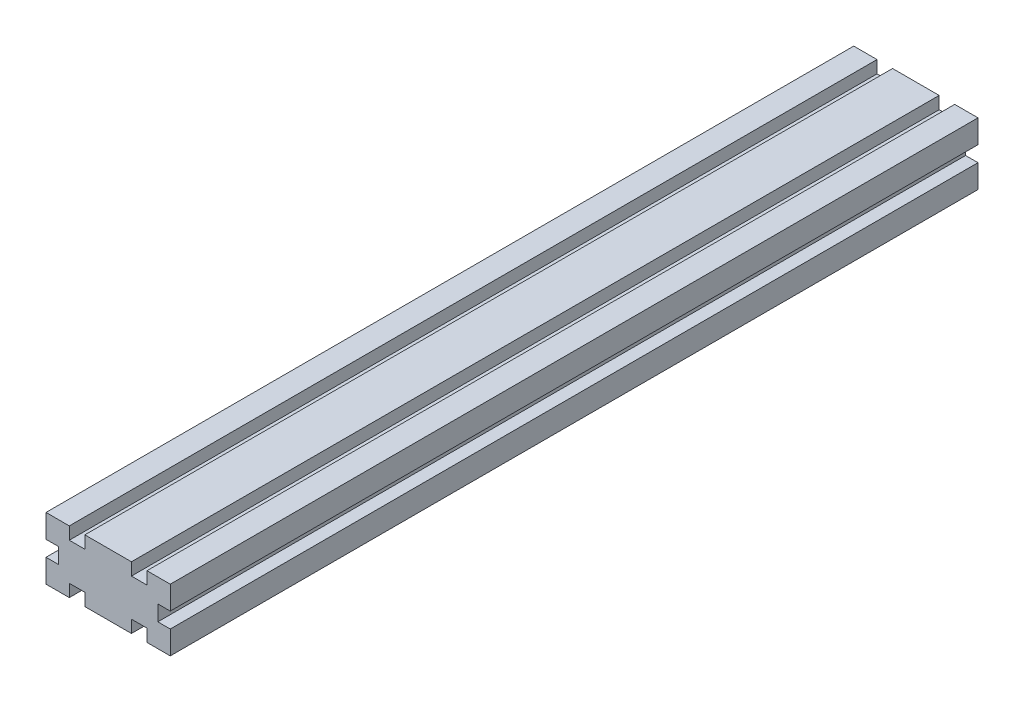
ISO-10303-21;
HEADER;
FILE_DESCRIPTION(('STEP AP214'),'2;1');
FILE_NAME('part.step','',(''),(''),'','','');
FILE_SCHEMA(('AUTOMOTIVE_DESIGN { 1 0 10303 214 1 1 1 1 }'));
ENDSEC;
DATA;
#1=APPLICATION_CONTEXT('core data for automotive mechanical design processes');
#2=APPLICATION_PROTOCOL_DEFINITION('international standard','automotive_design',2000,#1);
#3=PRODUCT_CONTEXT('',#1,'mechanical');
#4=PRODUCT('Part','Part','',(#3));
#5=PRODUCT_RELATED_PRODUCT_CATEGORY('part','',(#4));
#6=PRODUCT_DEFINITION_FORMATION('','',#4);
#7=PRODUCT_DEFINITION_CONTEXT('part definition',#1,'design');
#8=PRODUCT_DEFINITION('design','',#6,#7);
#9=PRODUCT_DEFINITION_SHAPE('','',#8);
#10=(LENGTH_UNIT() NAMED_UNIT(*) SI_UNIT(.MILLI.,.METRE.));
#11=(NAMED_UNIT(*) PLANE_ANGLE_UNIT() SI_UNIT($,.RADIAN.));
#12=(NAMED_UNIT(*) SI_UNIT($,.STERADIAN.) SOLID_ANGLE_UNIT());
#13=UNCERTAINTY_MEASURE_WITH_UNIT(LENGTH_MEASURE(1.E-05),#10,'distance_accuracy_value','');
#14=(GEOMETRIC_REPRESENTATION_CONTEXT(3) GLOBAL_UNCERTAINTY_ASSIGNED_CONTEXT((#13)) GLOBAL_UNIT_ASSIGNED_CONTEXT((#10,
#11,#12)) REPRESENTATION_CONTEXT('',''));
#15=CARTESIAN_POINT('',(0.,0.,0.));
#16=DIRECTION('',(0.,0.,1.));
#17=DIRECTION('',(1.,0.,0.));
#18=AXIS2_PLACEMENT_3D('',#15,#16,#17);
#19=CARTESIAN_POINT('',(40.,0.,260.));
#20=DIRECTION('',(-1.,0.,0.));
#21=DIRECTION('',(0.,0.,1.));
#22=AXIS2_PLACEMENT_3D('',#19,#20,#21);
#23=PLANE('',#22);
#24=DIRECTION('',(0.,1.,0.));
#25=VECTOR('',#24,1.);
#26=CARTESIAN_POINT('',(40.,0.,0.));
#27=LINE('',#26,#25);
#28=CARTESIAN_POINT('',(40.,12.5,0.));
#29=VERTEX_POINT('',#28);
#30=CARTESIAN_POINT('',(40.,20.,0.));
#31=VERTEX_POINT('',#30);
#32=EDGE_CURVE('E252',#29,#31,#27,.T.);
#33=ORIENTED_EDGE('',*,*,#32,.T.);
#34=DIRECTION('',(0.,0.,-1.));
#35=VECTOR('',#34,1.);
#36=CARTESIAN_POINT('',(40.,20.,260.));
#37=LINE('',#36,#35);
#38=CARTESIAN_POINT('',(40.,20.,260.));
#39=VERTEX_POINT('',#38);
#40=EDGE_CURVE('E11',#39,#31,#37,.T.);
#41=ORIENTED_EDGE('',*,*,#40,.F.);
#42=DIRECTION('',(0.,1.,0.));
#43=VECTOR('',#42,1.);
#44=CARTESIAN_POINT('',(40.,0.,260.));
#45=LINE('',#44,#43);
#46=CARTESIAN_POINT('',(40.,12.5,260.));
#47=VERTEX_POINT('',#46);
#48=EDGE_CURVE('E151',#47,#39,#45,.T.);
#49=ORIENTED_EDGE('',*,*,#48,.F.);
#50=DIRECTION('',(0.,0.,-1.));
#51=VECTOR('',#50,1.);
#52=CARTESIAN_POINT('',(40.,12.5,260.));
#53=LINE('',#52,#51);
#54=EDGE_CURVE('E251',#47,#29,#53,.T.);
#55=ORIENTED_EDGE('',*,*,#54,.T.);
#56=EDGE_LOOP('',(#33,#41,#49,#55));
#57=FACE_BOUND('',#56,.T.);
#58=ADVANCED_FACE('F36',(#57),#23,.F.);
#59=CARTESIAN_POINT('',(0.,20.,260.));
#60=DIRECTION('',(0.,1.,0.));
#61=DIRECTION('',(0.,0.,1.));
#62=AXIS2_PLACEMENT_3D('',#59,#60,#61);
#63=PLANE('',#62);
#64=DIRECTION('',(1.,0.,0.));
#65=VECTOR('',#64,1.);
#66=CARTESIAN_POINT('',(0.,20.,0.));
#67=LINE('',#66,#65);
#68=CARTESIAN_POINT('',(32.5,20.,0.));
#69=VERTEX_POINT('',#68);
#70=EDGE_CURVE('E255',#69,#31,#67,.T.);
#71=ORIENTED_EDGE('',*,*,#70,.F.);
#72=DIRECTION('',(0.,0.,-1.));
#73=VECTOR('',#72,1.);
#74=CARTESIAN_POINT('',(32.5,20.,260.));
#75=LINE('',#74,#73);
#76=CARTESIAN_POINT('',(32.5,20.,260.));
#77=VERTEX_POINT('',#76);
#78=EDGE_CURVE('E44',#77,#69,#75,.T.);
#79=ORIENTED_EDGE('',*,*,#78,.F.);
#80=DIRECTION('',(1.,0.,0.));
#81=VECTOR('',#80,1.);
#82=CARTESIAN_POINT('',(0.,20.,260.));
#83=LINE('',#82,#81);
#84=EDGE_CURVE('E397',#77,#39,#83,.T.);
#85=ORIENTED_EDGE('',*,*,#84,.T.);
#86=ORIENTED_EDGE('',*,*,#40,.T.);
#87=EDGE_LOOP('',(#71,#79,#85,#86));
#88=FACE_BOUND('',#87,.T.);
#89=ADVANCED_FACE('F385',(#88),#63,.T.);
#90=CARTESIAN_POINT('',(32.5,0.,260.));
#91=DIRECTION('',(-1.,0.,0.));
#92=DIRECTION('',(0.,0.,1.));
#93=AXIS2_PLACEMENT_3D('',#90,#91,#92);
#94=PLANE('',#93);
#95=DIRECTION('',(0.,1.,0.));
#96=VECTOR('',#95,1.);
#97=CARTESIAN_POINT('',(32.5,0.,0.));
#98=LINE('',#97,#96);
#99=CARTESIAN_POINT('',(32.5,16.,0.));
#100=VERTEX_POINT('',#99);
#101=EDGE_CURVE('E258',#100,#69,#98,.T.);
#102=ORIENTED_EDGE('',*,*,#101,.F.);
#103=DIRECTION('',(0.,0.,-1.));
#104=VECTOR('',#103,1.);
#105=CARTESIAN_POINT('',(32.5,16.,260.));
#106=LINE('',#105,#104);
#107=CARTESIAN_POINT('',(32.5,16.,260.));
#108=VERTEX_POINT('',#107);
#109=EDGE_CURVE('E375',#108,#100,#106,.T.);
#110=ORIENTED_EDGE('',*,*,#109,.F.);
#111=DIRECTION('',(0.,1.,0.));
#112=VECTOR('',#111,1.);
#113=CARTESIAN_POINT('',(32.5,0.,260.));
#114=LINE('',#113,#112);
#115=EDGE_CURVE('E382',#108,#77,#114,.T.);
#116=ORIENTED_EDGE('',*,*,#115,.T.);
#117=ORIENTED_EDGE('',*,*,#78,.T.);
#118=EDGE_LOOP('',(#102,#110,#116,#117));
#119=FACE_BOUND('',#118,.T.);
#120=ADVANCED_FACE('F380',(#119),#94,.T.);
#121=CARTESIAN_POINT('',(0.,16.,260.));
#122=DIRECTION('',(0.,1.,0.));
#123=DIRECTION('',(0.,0.,1.));
#124=AXIS2_PLACEMENT_3D('',#121,#122,#123);
#125=PLANE('',#124);
#126=DIRECTION('',(1.,0.,0.));
#127=VECTOR('',#126,1.);
#128=CARTESIAN_POINT('',(0.,16.,0.));
#129=LINE('',#128,#127);
#130=CARTESIAN_POINT('',(27.5,16.,0.));
#131=VERTEX_POINT('',#130);
#132=EDGE_CURVE('E261',#131,#100,#129,.T.);
#133=ORIENTED_EDGE('',*,*,#132,.F.);
#134=DIRECTION('',(0.,0.,-1.));
#135=VECTOR('',#134,1.);
#136=CARTESIAN_POINT('',(27.5,16.,260.));
#137=LINE('',#136,#135);
#138=CARTESIAN_POINT('',(27.5,16.,260.));
#139=VERTEX_POINT('',#138);
#140=EDGE_CURVE('E373',#139,#131,#137,.T.);
#141=ORIENTED_EDGE('',*,*,#140,.F.);
#142=DIRECTION('',(1.,0.,0.));
#143=VECTOR('',#142,1.);
#144=CARTESIAN_POINT('',(0.,16.,260.));
#145=LINE('',#144,#143);
#146=EDGE_CURVE('E396',#139,#108,#145,.T.);
#147=ORIENTED_EDGE('',*,*,#146,.T.);
#148=ORIENTED_EDGE('',*,*,#109,.T.);
#149=EDGE_LOOP('',(#133,#141,#147,#148));
#150=FACE_BOUND('',#149,.T.);
#151=ADVANCED_FACE('F392',(#150),#125,.T.);
#152=CARTESIAN_POINT('',(27.5,0.,260.));
#153=DIRECTION('',(-1.,0.,0.));
#154=DIRECTION('',(0.,0.,1.));
#155=AXIS2_PLACEMENT_3D('',#152,#153,#154);
#156=PLANE('',#155);
#157=DIRECTION('',(0.,1.,0.));
#158=VECTOR('',#157,1.);
#159=CARTESIAN_POINT('',(27.5,0.,0.));
#160=LINE('',#159,#158);
#161=CARTESIAN_POINT('',(27.5,20.,0.));
#162=VERTEX_POINT('',#161);
#163=EDGE_CURVE('E264',#131,#162,#160,.T.);
#164=ORIENTED_EDGE('',*,*,#163,.T.);
#165=DIRECTION('',(0.,0.,-1.));
#166=VECTOR('',#165,1.);
#167=CARTESIAN_POINT('',(27.5,20.,260.));
#168=LINE('',#167,#166);
#169=CARTESIAN_POINT('',(27.5,20.,260.));
#170=VERTEX_POINT('',#169);
#171=EDGE_CURVE('E371',#170,#162,#168,.T.);
#172=ORIENTED_EDGE('',*,*,#171,.F.);
#173=DIRECTION('',(0.,1.,0.));
#174=VECTOR('',#173,1.);
#175=CARTESIAN_POINT('',(27.5,0.,260.));
#176=LINE('',#175,#174);
#177=EDGE_CURVE('E399',#139,#170,#176,.T.);
#178=ORIENTED_EDGE('',*,*,#177,.F.);
#179=ORIENTED_EDGE('',*,*,#140,.T.);
#180=EDGE_LOOP('',(#164,#172,#178,#179));
#181=FACE_BOUND('',#180,.T.);
#182=ADVANCED_FACE('F481',(#181),#156,.F.);
#183=CARTESIAN_POINT('',(0.,20.,260.));
#184=DIRECTION('',(0.,1.,0.));
#185=DIRECTION('',(0.,0.,1.));
#186=AXIS2_PLACEMENT_3D('',#183,#184,#185);
#187=PLANE('',#186);
#188=DIRECTION('',(1.,0.,0.));
#189=VECTOR('',#188,1.);
#190=CARTESIAN_POINT('',(0.,20.,0.));
#191=LINE('',#190,#189);
#192=CARTESIAN_POINT('',(12.5,20.,0.));
#193=VERTEX_POINT('',#192);
#194=EDGE_CURVE('E267',#193,#162,#191,.T.);
#195=ORIENTED_EDGE('',*,*,#194,.F.);
#196=DIRECTION('',(0.,0.,-1.));
#197=VECTOR('',#196,1.);
#198=CARTESIAN_POINT('',(12.5,20.,260.));
#199=LINE('',#198,#197);
#200=CARTESIAN_POINT('',(12.5,20.,260.));
#201=VERTEX_POINT('',#200);
#202=EDGE_CURVE('E369',#201,#193,#199,.T.);
#203=ORIENTED_EDGE('',*,*,#202,.F.);
#204=DIRECTION('',(1.,0.,0.));
#205=VECTOR('',#204,1.);
#206=CARTESIAN_POINT('',(0.,20.,260.));
#207=LINE('',#206,#205);
#208=EDGE_CURVE('E405',#201,#170,#207,.T.);
#209=ORIENTED_EDGE('',*,*,#208,.T.);
#210=ORIENTED_EDGE('',*,*,#171,.T.);
#211=EDGE_LOOP('',(#195,#203,#209,#210));
#212=FACE_BOUND('',#211,.T.);
#213=ADVANCED_FACE('F484',(#212),#187,.T.);
#214=CARTESIAN_POINT('',(12.5,0.,260.));
#215=DIRECTION('',(-1.,0.,0.));
#216=DIRECTION('',(0.,0.,1.));
#217=AXIS2_PLACEMENT_3D('',#214,#215,#216);
#218=PLANE('',#217);
#219=DIRECTION('',(0.,1.,0.));
#220=VECTOR('',#219,1.);
#221=CARTESIAN_POINT('',(12.5,0.,0.));
#222=LINE('',#221,#220);
#223=CARTESIAN_POINT('',(12.5,16.,0.));
#224=VERTEX_POINT('',#223);
#225=EDGE_CURVE('E270',#224,#193,#222,.T.);
#226=ORIENTED_EDGE('',*,*,#225,.F.);
#227=DIRECTION('',(0.,0.,-1.));
#228=VECTOR('',#227,1.);
#229=CARTESIAN_POINT('',(12.5,16.,260.));
#230=LINE('',#229,#228);
#231=CARTESIAN_POINT('',(12.5,16.,260.));
#232=VERTEX_POINT('',#231);
#233=EDGE_CURVE('E367',#232,#224,#230,.T.);
#234=ORIENTED_EDGE('',*,*,#233,.F.);
#235=DIRECTION('',(0.,1.,0.));
#236=VECTOR('',#235,1.);
#237=CARTESIAN_POINT('',(12.5,0.,260.));
#238=LINE('',#237,#236);
#239=EDGE_CURVE('E408',#232,#201,#238,.T.);
#240=ORIENTED_EDGE('',*,*,#239,.T.);
#241=ORIENTED_EDGE('',*,*,#202,.T.);
#242=EDGE_LOOP('',(#226,#234,#240,#241));
#243=FACE_BOUND('',#242,.T.);
#244=ADVANCED_FACE('F488',(#243),#218,.T.);
#245=CARTESIAN_POINT('',(0.,16.,260.));
#246=DIRECTION('',(0.,1.,0.));
#247=DIRECTION('',(0.,0.,1.));
#248=AXIS2_PLACEMENT_3D('',#245,#246,#247);
#249=PLANE('',#248);
#250=DIRECTION('',(1.,0.,0.));
#251=VECTOR('',#250,1.);
#252=CARTESIAN_POINT('',(0.,16.,0.));
#253=LINE('',#252,#251);
#254=CARTESIAN_POINT('',(7.5,16.,0.));
#255=VERTEX_POINT('',#254);
#256=EDGE_CURVE('E273',#255,#224,#253,.T.);
#257=ORIENTED_EDGE('',*,*,#256,.F.);
#258=DIRECTION('',(0.,0.,-1.));
#259=VECTOR('',#258,1.);
#260=CARTESIAN_POINT('',(7.5,16.,260.));
#261=LINE('',#260,#259);
#262=CARTESIAN_POINT('',(7.5,16.,260.));
#263=VERTEX_POINT('',#262);
#264=EDGE_CURVE('E365',#263,#255,#261,.T.);
#265=ORIENTED_EDGE('',*,*,#264,.F.);
#266=DIRECTION('',(1.,0.,0.));
#267=VECTOR('',#266,1.);
#268=CARTESIAN_POINT('',(0.,16.,260.));
#269=LINE('',#268,#267);
#270=EDGE_CURVE('E411',#263,#232,#269,.T.);
#271=ORIENTED_EDGE('',*,*,#270,.T.);
#272=ORIENTED_EDGE('',*,*,#233,.T.);
#273=EDGE_LOOP('',(#257,#265,#271,#272));
#274=FACE_BOUND('',#273,.T.);
#275=ADVANCED_FACE('F492',(#274),#249,.T.);
#276=CARTESIAN_POINT('',(7.5,0.,260.));
#277=DIRECTION('',(-1.,0.,0.));
#278=DIRECTION('',(0.,0.,1.));
#279=AXIS2_PLACEMENT_3D('',#276,#277,#278);
#280=PLANE('',#279);
#281=DIRECTION('',(0.,1.,0.));
#282=VECTOR('',#281,1.);
#283=CARTESIAN_POINT('',(7.5,0.,0.));
#284=LINE('',#283,#282);
#285=CARTESIAN_POINT('',(7.5,20.,0.));
#286=VERTEX_POINT('',#285);
#287=EDGE_CURVE('E276',#255,#286,#284,.T.);
#288=ORIENTED_EDGE('',*,*,#287,.T.);
#289=DIRECTION('',(0.,0.,-1.));
#290=VECTOR('',#289,1.);
#291=CARTESIAN_POINT('',(7.5,20.,260.));
#292=LINE('',#291,#290);
#293=CARTESIAN_POINT('',(7.5,20.,260.));
#294=VERTEX_POINT('',#293);
#295=EDGE_CURVE('E363',#294,#286,#292,.T.);
#296=ORIENTED_EDGE('',*,*,#295,.F.);
#297=DIRECTION('',(0.,1.,0.));
#298=VECTOR('',#297,1.);
#299=CARTESIAN_POINT('',(7.5,0.,260.));
#300=LINE('',#299,#298);
#301=EDGE_CURVE('E414',#263,#294,#300,.T.);
#302=ORIENTED_EDGE('',*,*,#301,.F.);
#303=ORIENTED_EDGE('',*,*,#264,.T.);
#304=EDGE_LOOP('',(#288,#296,#302,#303));
#305=FACE_BOUND('',#304,.T.);
#306=ADVANCED_FACE('F496',(#305),#280,.F.);
#307=CARTESIAN_POINT('',(0.,20.,260.));
#308=DIRECTION('',(0.,1.,0.));
#309=DIRECTION('',(0.,0.,1.));
#310=AXIS2_PLACEMENT_3D('',#307,#308,#309);
#311=PLANE('',#310);
#312=DIRECTION('',(1.,0.,0.));
#313=VECTOR('',#312,1.);
#314=CARTESIAN_POINT('',(0.,20.,0.));
#315=LINE('',#314,#313);
#316=CARTESIAN_POINT('',(0.,20.,0.));
#317=VERTEX_POINT('',#316);
#318=EDGE_CURVE('E279',#317,#286,#315,.T.);
#319=ORIENTED_EDGE('',*,*,#318,.F.);
#320=DIRECTION('',(0.,0.,-1.));
#321=VECTOR('',#320,1.);
#322=CARTESIAN_POINT('',(0.,20.,260.));
#323=LINE('',#322,#321);
#324=CARTESIAN_POINT('',(0.,20.,260.));
#325=VERTEX_POINT('',#324);
#326=EDGE_CURVE('E361',#325,#317,#323,.T.);
#327=ORIENTED_EDGE('',*,*,#326,.F.);
#328=DIRECTION('',(1.,0.,0.));
#329=VECTOR('',#328,1.);
#330=CARTESIAN_POINT('',(0.,20.,260.));
#331=LINE('',#330,#329);
#332=EDGE_CURVE('E416',#325,#294,#331,.T.);
#333=ORIENTED_EDGE('',*,*,#332,.T.);
#334=ORIENTED_EDGE('',*,*,#295,.T.);
#335=EDGE_LOOP('',(#319,#327,#333,#334));
#336=FACE_BOUND('',#335,.T.);
#337=ADVANCED_FACE('F500',(#336),#311,.T.);
#338=CARTESIAN_POINT('',(0.,0.,260.));
#339=DIRECTION('',(-1.,0.,0.));
#340=DIRECTION('',(0.,0.,1.));
#341=AXIS2_PLACEMENT_3D('',#338,#339,#340);
#342=PLANE('',#341);
#343=DIRECTION('',(0.,1.,0.));
#344=VECTOR('',#343,1.);
#345=CARTESIAN_POINT('',(0.,0.,0.));
#346=LINE('',#345,#344);
#347=CARTESIAN_POINT('',(0.,12.5,0.));
#348=VERTEX_POINT('',#347);
#349=EDGE_CURVE('E282',#348,#317,#346,.T.);
#350=ORIENTED_EDGE('',*,*,#349,.F.);
#351=DIRECTION('',(0.,0.,-1.));
#352=VECTOR('',#351,1.);
#353=CARTESIAN_POINT('',(0.,12.5,260.));
#354=LINE('',#353,#352);
#355=CARTESIAN_POINT('',(0.,12.5,260.));
#356=VERTEX_POINT('',#355);
#357=EDGE_CURVE('E359',#356,#348,#354,.T.);
#358=ORIENTED_EDGE('',*,*,#357,.F.);
#359=DIRECTION('',(0.,1.,0.));
#360=VECTOR('',#359,1.);
#361=CARTESIAN_POINT('',(0.,0.,260.));
#362=LINE('',#361,#360);
#363=EDGE_CURVE('E419',#356,#325,#362,.T.);
#364=ORIENTED_EDGE('',*,*,#363,.T.);
#365=ORIENTED_EDGE('',*,*,#326,.T.);
#366=EDGE_LOOP('',(#350,#358,#364,#365));
#367=FACE_BOUND('',#366,.T.);
#368=ADVANCED_FACE('F504',(#367),#342,.T.);
#369=CARTESIAN_POINT('',(0.,12.5,260.));
#370=DIRECTION('',(0.,1.,0.));
#371=DIRECTION('',(-1.,0.,0.));
#372=AXIS2_PLACEMENT_3D('',#369,#370,#371);
#373=PLANE('',#372);
#374=DIRECTION('',(1.,0.,0.));
#375=VECTOR('',#374,1.);
#376=CARTESIAN_POINT('',(0.,12.5,0.));
#377=LINE('',#376,#375);
#378=CARTESIAN_POINT('',(4.,12.5,0.));
#379=VERTEX_POINT('',#378);
#380=EDGE_CURVE('E285',#348,#379,#377,.T.);
#381=ORIENTED_EDGE('',*,*,#380,.T.);
#382=DIRECTION('',(0.,0.,-1.));
#383=VECTOR('',#382,1.);
#384=CARTESIAN_POINT('',(4.,12.5,260.));
#385=LINE('',#384,#383);
#386=CARTESIAN_POINT('',(4.,12.5,260.));
#387=VERTEX_POINT('',#386);
#388=EDGE_CURVE('E357',#387,#379,#385,.T.);
#389=ORIENTED_EDGE('',*,*,#388,.F.);
#390=DIRECTION('',(1.,0.,0.));
#391=VECTOR('',#390,1.);
#392=CARTESIAN_POINT('',(0.,12.5,260.));
#393=LINE('',#392,#391);
#394=EDGE_CURVE('E422',#356,#387,#393,.T.);
#395=ORIENTED_EDGE('',*,*,#394,.F.);
#396=ORIENTED_EDGE('',*,*,#357,.T.);
#397=EDGE_LOOP('',(#381,#389,#395,#396));
#398=FACE_BOUND('',#397,.T.);
#399=ADVANCED_FACE('F508',(#398),#373,.F.);
#400=CARTESIAN_POINT('',(4.,0.,260.));
#401=DIRECTION('',(-1.,0.,0.));
#402=DIRECTION('',(0.,0.,1.));
#403=AXIS2_PLACEMENT_3D('',#400,#401,#402);
#404=PLANE('',#403);
#405=DIRECTION('',(0.,1.,0.));
#406=VECTOR('',#405,1.);
#407=CARTESIAN_POINT('',(4.,0.,0.));
#408=LINE('',#407,#406);
#409=CARTESIAN_POINT('',(4.,7.5,0.));
#410=VERTEX_POINT('',#409);
#411=EDGE_CURVE('E288',#410,#379,#408,.T.);
#412=ORIENTED_EDGE('',*,*,#411,.F.);
#413=DIRECTION('',(0.,0.,-1.));
#414=VECTOR('',#413,1.);
#415=CARTESIAN_POINT('',(4.,7.5,260.));
#416=LINE('',#415,#414);
#417=CARTESIAN_POINT('',(4.,7.5,260.));
#418=VERTEX_POINT('',#417);
#419=EDGE_CURVE('E355',#418,#410,#416,.T.);
#420=ORIENTED_EDGE('',*,*,#419,.F.);
#421=DIRECTION('',(0.,1.,0.));
#422=VECTOR('',#421,1.);
#423=CARTESIAN_POINT('',(4.,0.,260.));
#424=LINE('',#423,#422);
#425=EDGE_CURVE('E424',#418,#387,#424,.T.);
#426=ORIENTED_EDGE('',*,*,#425,.T.);
#427=ORIENTED_EDGE('',*,*,#388,.T.);
#428=EDGE_LOOP('',(#412,#420,#426,#427));
#429=FACE_BOUND('',#428,.T.);
#430=ADVANCED_FACE('F512',(#429),#404,.T.);
#431=CARTESIAN_POINT('',(0.,7.5,260.));
#432=DIRECTION('',(0.,1.,0.));
#433=DIRECTION('',(-1.,0.,0.));
#434=AXIS2_PLACEMENT_3D('',#431,#432,#433);
#435=PLANE('',#434);
#436=DIRECTION('',(1.,0.,0.));
#437=VECTOR('',#436,1.);
#438=CARTESIAN_POINT('',(0.,7.5,0.));
#439=LINE('',#438,#437);
#440=CARTESIAN_POINT('',(0.,7.5,0.));
#441=VERTEX_POINT('',#440);
#442=EDGE_CURVE('E291',#441,#410,#439,.T.);
#443=ORIENTED_EDGE('',*,*,#442,.F.);
#444=DIRECTION('',(0.,0.,-1.));
#445=VECTOR('',#444,1.);
#446=CARTESIAN_POINT('',(0.,7.5,260.));
#447=LINE('',#446,#445);
#448=CARTESIAN_POINT('',(0.,7.5,260.));
#449=VERTEX_POINT('',#448);
#450=EDGE_CURVE('E353',#449,#441,#447,.T.);
#451=ORIENTED_EDGE('',*,*,#450,.F.);
#452=DIRECTION('',(1.,0.,0.));
#453=VECTOR('',#452,1.);
#454=CARTESIAN_POINT('',(0.,7.5,260.));
#455=LINE('',#454,#453);
#456=EDGE_CURVE('E427',#449,#418,#455,.T.);
#457=ORIENTED_EDGE('',*,*,#456,.T.);
#458=ORIENTED_EDGE('',*,*,#419,.T.);
#459=EDGE_LOOP('',(#443,#451,#457,#458));
#460=FACE_BOUND('',#459,.T.);
#461=ADVANCED_FACE('F516',(#460),#435,.T.);
#462=CARTESIAN_POINT('',(0.,0.,260.));
#463=DIRECTION('',(-1.,0.,0.));
#464=DIRECTION('',(0.,0.,1.));
#465=AXIS2_PLACEMENT_3D('',#462,#463,#464);
#466=PLANE('',#465);
#467=DIRECTION('',(0.,1.,0.));
#468=VECTOR('',#467,1.);
#469=CARTESIAN_POINT('',(0.,0.,0.));
#470=LINE('',#469,#468);
#471=CARTESIAN_POINT('',(0.,0.,0.));
#472=VERTEX_POINT('',#471);
#473=EDGE_CURVE('E294',#472,#441,#470,.T.);
#474=ORIENTED_EDGE('',*,*,#473,.F.);
#475=DIRECTION('',(0.,0.,-1.));
#476=VECTOR('',#475,1.);
#477=CARTESIAN_POINT('',(0.,0.,260.));
#478=LINE('',#477,#476);
#479=CARTESIAN_POINT('',(0.,0.,260.));
#480=VERTEX_POINT('',#479);
#481=EDGE_CURVE('E351',#480,#472,#478,.T.);
#482=ORIENTED_EDGE('',*,*,#481,.F.);
#483=DIRECTION('',(0.,1.,0.));
#484=VECTOR('',#483,1.);
#485=CARTESIAN_POINT('',(0.,0.,260.));
#486=LINE('',#485,#484);
#487=EDGE_CURVE('E430',#480,#449,#486,.T.);
#488=ORIENTED_EDGE('',*,*,#487,.T.);
#489=ORIENTED_EDGE('',*,*,#450,.T.);
#490=EDGE_LOOP('',(#474,#482,#488,#489));
#491=FACE_BOUND('',#490,.T.);
#492=ADVANCED_FACE('F520',(#491),#466,.T.);
#493=CARTESIAN_POINT('',(0.,0.,260.));
#494=DIRECTION('',(0.,1.,0.));
#495=DIRECTION('',(0.,0.,1.));
#496=AXIS2_PLACEMENT_3D('',#493,#494,#495);
#497=PLANE('',#496);
#498=DIRECTION('',(1.,0.,0.));
#499=VECTOR('',#498,1.);
#500=CARTESIAN_POINT('',(0.,0.,0.));
#501=LINE('',#500,#499);
#502=CARTESIAN_POINT('',(7.5,0.,0.));
#503=VERTEX_POINT('',#502);
#504=EDGE_CURVE('E297',#472,#503,#501,.T.);
#505=ORIENTED_EDGE('',*,*,#504,.T.);
#506=DIRECTION('',(0.,0.,-1.));
#507=VECTOR('',#506,1.);
#508=CARTESIAN_POINT('',(7.5,0.,260.));
#509=LINE('',#508,#507);
#510=CARTESIAN_POINT('',(7.5,0.,260.));
#511=VERTEX_POINT('',#510);
#512=EDGE_CURVE('E348',#511,#503,#509,.T.);
#513=ORIENTED_EDGE('',*,*,#512,.F.);
#514=DIRECTION('',(1.,0.,0.));
#515=VECTOR('',#514,1.);
#516=CARTESIAN_POINT('',(0.,0.,260.));
#517=LINE('',#516,#515);
#518=EDGE_CURVE('E433',#480,#511,#517,.T.);
#519=ORIENTED_EDGE('',*,*,#518,.F.);
#520=ORIENTED_EDGE('',*,*,#481,.T.);
#521=EDGE_LOOP('',(#505,#513,#519,#520));
#522=FACE_BOUND('',#521,.T.);
#523=ADVANCED_FACE('F524',(#522),#497,.F.);
#524=CARTESIAN_POINT('',(7.5,0.,260.));
#525=DIRECTION('',(-1.,0.,0.));
#526=DIRECTION('',(0.,0.,1.));
#527=AXIS2_PLACEMENT_3D('',#524,#525,#526);
#528=PLANE('',#527);
#529=DIRECTION('',(0.,1.,0.));
#530=VECTOR('',#529,1.);
#531=CARTESIAN_POINT('',(7.5,0.,0.));
#532=LINE('',#531,#530);
#533=CARTESIAN_POINT('',(7.5,4.,0.));
#534=VERTEX_POINT('',#533);
#535=EDGE_CURVE('E299',#503,#534,#532,.T.);
#536=ORIENTED_EDGE('',*,*,#535,.T.);
#537=DIRECTION('',(0.,0.,-1.));
#538=VECTOR('',#537,1.);
#539=CARTESIAN_POINT('',(7.5,4.,260.));
#540=LINE('',#539,#538);
#541=CARTESIAN_POINT('',(7.5,4.,260.));
#542=VERTEX_POINT('',#541);
#543=EDGE_CURVE('E345',#542,#534,#540,.T.);
#544=ORIENTED_EDGE('',*,*,#543,.F.);
#545=DIRECTION('',(0.,1.,0.));
#546=VECTOR('',#545,1.);
#547=CARTESIAN_POINT('',(7.5,0.,260.));
#548=LINE('',#547,#546);
#549=EDGE_CURVE('E435',#511,#542,#548,.T.);
#550=ORIENTED_EDGE('',*,*,#549,.F.);
#551=ORIENTED_EDGE('',*,*,#512,.T.);
#552=EDGE_LOOP('',(#536,#544,#550,#551));
#553=FACE_BOUND('',#552,.T.);
#554=ADVANCED_FACE('F528',(#553),#528,.F.);
#555=CARTESIAN_POINT('',(0.,4.,260.));
#556=DIRECTION('',(0.,1.,0.));
#557=DIRECTION('',(0.,0.,1.));
#558=AXIS2_PLACEMENT_3D('',#555,#556,#557);
#559=PLANE('',#558);
#560=DIRECTION('',(1.,0.,0.));
#561=VECTOR('',#560,1.);
#562=CARTESIAN_POINT('',(0.,4.,0.));
#563=LINE('',#562,#561);
#564=CARTESIAN_POINT('',(12.5,4.,0.));
#565=VERTEX_POINT('',#564);
#566=EDGE_CURVE('E301',#534,#565,#563,.T.);
#567=ORIENTED_EDGE('',*,*,#566,.T.);
#568=DIRECTION('',(0.,0.,-1.));
#569=VECTOR('',#568,1.);
#570=CARTESIAN_POINT('',(12.5,4.,260.));
#571=LINE('',#570,#569);
#572=CARTESIAN_POINT('',(12.5,4.,260.));
#573=VERTEX_POINT('',#572);
#574=EDGE_CURVE('E343',#573,#565,#571,.T.);
#575=ORIENTED_EDGE('',*,*,#574,.F.);
#576=DIRECTION('',(1.,0.,0.));
#577=VECTOR('',#576,1.);
#578=CARTESIAN_POINT('',(0.,4.,260.));
#579=LINE('',#578,#577);
#580=EDGE_CURVE('E437',#542,#573,#579,.T.);
#581=ORIENTED_EDGE('',*,*,#580,.F.);
#582=ORIENTED_EDGE('',*,*,#543,.T.);
#583=EDGE_LOOP('',(#567,#575,#581,#582));
#584=FACE_BOUND('',#583,.T.);
#585=ADVANCED_FACE('F532',(#584),#559,.F.);
#586=CARTESIAN_POINT('',(12.5,0.,260.));
#587=DIRECTION('',(-1.,0.,0.));
#588=DIRECTION('',(0.,0.,1.));
#589=AXIS2_PLACEMENT_3D('',#586,#587,#588);
#590=PLANE('',#589);
#591=DIRECTION('',(0.,1.,0.));
#592=VECTOR('',#591,1.);
#593=CARTESIAN_POINT('',(12.5,0.,0.));
#594=LINE('',#593,#592);
#595=CARTESIAN_POINT('',(12.5,0.,0.));
#596=VERTEX_POINT('',#595);
#597=EDGE_CURVE('E304',#596,#565,#594,.T.);
#598=ORIENTED_EDGE('',*,*,#597,.F.);
#599=DIRECTION('',(0.,0.,-1.));
#600=VECTOR('',#599,1.);
#601=CARTESIAN_POINT('',(12.5,0.,260.));
#602=LINE('',#601,#600);
#603=CARTESIAN_POINT('',(12.5,0.,260.));
#604=VERTEX_POINT('',#603);
#605=EDGE_CURVE('E341',#604,#596,#602,.T.);
#606=ORIENTED_EDGE('',*,*,#605,.F.);
#607=DIRECTION('',(0.,1.,0.));
#608=VECTOR('',#607,1.);
#609=CARTESIAN_POINT('',(12.5,0.,260.));
#610=LINE('',#609,#608);
#611=EDGE_CURVE('E439',#604,#573,#610,.T.);
#612=ORIENTED_EDGE('',*,*,#611,.T.);
#613=ORIENTED_EDGE('',*,*,#574,.T.);
#614=EDGE_LOOP('',(#598,#606,#612,#613));
#615=FACE_BOUND('',#614,.T.);
#616=ADVANCED_FACE('F536',(#615),#590,.T.);
#617=CARTESIAN_POINT('',(0.,0.,260.));
#618=DIRECTION('',(0.,1.,0.));
#619=DIRECTION('',(0.,0.,1.));
#620=AXIS2_PLACEMENT_3D('',#617,#618,#619);
#621=PLANE('',#620);
#622=DIRECTION('',(1.,0.,0.));
#623=VECTOR('',#622,1.);
#624=CARTESIAN_POINT('',(0.,0.,0.));
#625=LINE('',#624,#623);
#626=CARTESIAN_POINT('',(27.5,0.,0.));
#627=VERTEX_POINT('',#626);
#628=EDGE_CURVE('E307',#596,#627,#625,.T.);
#629=ORIENTED_EDGE('',*,*,#628,.T.);
#630=DIRECTION('',(0.,0.,-1.));
#631=VECTOR('',#630,1.);
#632=CARTESIAN_POINT('',(27.5,0.,260.));
#633=LINE('',#632,#631);
#634=CARTESIAN_POINT('',(27.5,0.,260.));
#635=VERTEX_POINT('',#634);
#636=EDGE_CURVE('E338',#635,#627,#633,.T.);
#637=ORIENTED_EDGE('',*,*,#636,.F.);
#638=DIRECTION('',(1.,0.,0.));
#639=VECTOR('',#638,1.);
#640=CARTESIAN_POINT('',(0.,0.,260.));
#641=LINE('',#640,#639);
#642=EDGE_CURVE('E442',#604,#635,#641,.T.);
#643=ORIENTED_EDGE('',*,*,#642,.F.);
#644=ORIENTED_EDGE('',*,*,#605,.T.);
#645=EDGE_LOOP('',(#629,#637,#643,#644));
#646=FACE_BOUND('',#645,.T.);
#647=ADVANCED_FACE('F540',(#646),#621,.F.);
#648=CARTESIAN_POINT('',(27.5,0.,260.));
#649=DIRECTION('',(-1.,0.,0.));
#650=DIRECTION('',(0.,0.,1.));
#651=AXIS2_PLACEMENT_3D('',#648,#649,#650);
#652=PLANE('',#651);
#653=DIRECTION('',(0.,1.,0.));
#654=VECTOR('',#653,1.);
#655=CARTESIAN_POINT('',(27.5,0.,0.));
#656=LINE('',#655,#654);
#657=CARTESIAN_POINT('',(27.5,3.99999999999999,0.));
#658=VERTEX_POINT('',#657);
#659=EDGE_CURVE('E309',#627,#658,#656,.T.);
#660=ORIENTED_EDGE('',*,*,#659,.T.);
#661=DIRECTION('',(0.,0.,-1.));
#662=VECTOR('',#661,1.);
#663=CARTESIAN_POINT('',(27.5,3.99999999999999,260.));
#664=LINE('',#663,#662);
#665=CARTESIAN_POINT('',(27.5,3.99999999999999,260.));
#666=VERTEX_POINT('',#665);
#667=EDGE_CURVE('E335',#666,#658,#664,.T.);
#668=ORIENTED_EDGE('',*,*,#667,.F.);
#669=DIRECTION('',(0.,1.,0.));
#670=VECTOR('',#669,1.);
#671=CARTESIAN_POINT('',(27.5,0.,260.));
#672=LINE('',#671,#670);
#673=EDGE_CURVE('E444',#635,#666,#672,.T.);
#674=ORIENTED_EDGE('',*,*,#673,.F.);
#675=ORIENTED_EDGE('',*,*,#636,.T.);
#676=EDGE_LOOP('',(#660,#668,#674,#675));
#677=FACE_BOUND('',#676,.T.);
#678=ADVANCED_FACE('F544',(#677),#652,.F.);
#679=CARTESIAN_POINT('',(0.,3.99999999999999,260.));
#680=DIRECTION('',(0.,1.,0.));
#681=DIRECTION('',(0.,0.,1.));
#682=AXIS2_PLACEMENT_3D('',#679,#680,#681);
#683=PLANE('',#682);
#684=DIRECTION('',(1.,0.,0.));
#685=VECTOR('',#684,1.);
#686=CARTESIAN_POINT('',(0.,3.99999999999999,0.));
#687=LINE('',#686,#685);
#688=CARTESIAN_POINT('',(32.5,3.99999999999999,0.));
#689=VERTEX_POINT('',#688);
#690=EDGE_CURVE('E311',#658,#689,#687,.T.);
#691=ORIENTED_EDGE('',*,*,#690,.T.);
#692=DIRECTION('',(0.,0.,-1.));
#693=VECTOR('',#692,1.);
#694=CARTESIAN_POINT('',(32.5,3.99999999999999,260.));
#695=LINE('',#694,#693);
#696=CARTESIAN_POINT('',(32.5,3.99999999999999,260.));
#697=VERTEX_POINT('',#696);
#698=EDGE_CURVE('E333',#697,#689,#695,.T.);
#699=ORIENTED_EDGE('',*,*,#698,.F.);
#700=DIRECTION('',(1.,0.,0.));
#701=VECTOR('',#700,1.);
#702=CARTESIAN_POINT('',(0.,3.99999999999999,260.));
#703=LINE('',#702,#701);
#704=EDGE_CURVE('E446',#666,#697,#703,.T.);
#705=ORIENTED_EDGE('',*,*,#704,.F.);
#706=ORIENTED_EDGE('',*,*,#667,.T.);
#707=EDGE_LOOP('',(#691,#699,#705,#706));
#708=FACE_BOUND('',#707,.T.);
#709=ADVANCED_FACE('F548',(#708),#683,.F.);
#710=CARTESIAN_POINT('',(32.5,0.,260.));
#711=DIRECTION('',(-1.,0.,0.));
#712=DIRECTION('',(0.,0.,1.));
#713=AXIS2_PLACEMENT_3D('',#710,#711,#712);
#714=PLANE('',#713);
#715=DIRECTION('',(0.,1.,0.));
#716=VECTOR('',#715,1.);
#717=CARTESIAN_POINT('',(32.5,0.,0.));
#718=LINE('',#717,#716);
#719=CARTESIAN_POINT('',(32.5,0.,0.));
#720=VERTEX_POINT('',#719);
#721=EDGE_CURVE('E314',#720,#689,#718,.T.);
#722=ORIENTED_EDGE('',*,*,#721,.F.);
#723=DIRECTION('',(0.,0.,-1.));
#724=VECTOR('',#723,1.);
#725=CARTESIAN_POINT('',(32.5,0.,260.));
#726=LINE('',#725,#724);
#727=CARTESIAN_POINT('',(32.5,0.,260.));
#728=VERTEX_POINT('',#727);
#729=EDGE_CURVE('E331',#728,#720,#726,.T.);
#730=ORIENTED_EDGE('',*,*,#729,.F.);
#731=DIRECTION('',(0.,1.,0.));
#732=VECTOR('',#731,1.);
#733=CARTESIAN_POINT('',(32.5,0.,260.));
#734=LINE('',#733,#732);
#735=EDGE_CURVE('E448',#728,#697,#734,.T.);
#736=ORIENTED_EDGE('',*,*,#735,.T.);
#737=ORIENTED_EDGE('',*,*,#698,.T.);
#738=EDGE_LOOP('',(#722,#730,#736,#737));
#739=FACE_BOUND('',#738,.T.);
#740=ADVANCED_FACE('F552',(#739),#714,.T.);
#741=CARTESIAN_POINT('',(0.,0.,260.));
#742=DIRECTION('',(0.,1.,0.));
#743=DIRECTION('',(0.,0.,1.));
#744=AXIS2_PLACEMENT_3D('',#741,#742,#743);
#745=PLANE('',#744);
#746=DIRECTION('',(1.,0.,0.));
#747=VECTOR('',#746,1.);
#748=CARTESIAN_POINT('',(0.,0.,0.));
#749=LINE('',#748,#747);
#750=CARTESIAN_POINT('',(40.,0.,0.));
#751=VERTEX_POINT('',#750);
#752=EDGE_CURVE('E317',#720,#751,#749,.T.);
#753=ORIENTED_EDGE('',*,*,#752,.T.);
#754=DIRECTION('',(0.,0.,-1.));
#755=VECTOR('',#754,1.);
#756=CARTESIAN_POINT('',(40.,0.,260.));
#757=LINE('',#756,#755);
#758=CARTESIAN_POINT('',(40.,0.,260.));
#759=VERTEX_POINT('',#758);
#760=EDGE_CURVE('E328',#759,#751,#757,.T.);
#761=ORIENTED_EDGE('',*,*,#760,.F.);
#762=DIRECTION('',(1.,0.,0.));
#763=VECTOR('',#762,1.);
#764=CARTESIAN_POINT('',(0.,0.,260.));
#765=LINE('',#764,#763);
#766=EDGE_CURVE('E246',#728,#759,#765,.T.);
#767=ORIENTED_EDGE('',*,*,#766,.F.);
#768=ORIENTED_EDGE('',*,*,#729,.T.);
#769=EDGE_LOOP('',(#753,#761,#767,#768));
#770=FACE_BOUND('',#769,.T.);
#771=ADVANCED_FACE('F454',(#770),#745,.F.);
#772=CARTESIAN_POINT('',(40.,0.,260.));
#773=DIRECTION('',(-1.,0.,0.));
#774=DIRECTION('',(0.,0.,1.));
#775=AXIS2_PLACEMENT_3D('',#772,#773,#774);
#776=PLANE('',#775);
#777=DIRECTION('',(0.,1.,0.));
#778=VECTOR('',#777,1.);
#779=CARTESIAN_POINT('',(40.,0.,0.));
#780=LINE('',#779,#778);
#781=CARTESIAN_POINT('',(40.,7.5,0.));
#782=VERTEX_POINT('',#781);
#783=EDGE_CURVE('E319',#751,#782,#780,.T.);
#784=ORIENTED_EDGE('',*,*,#783,.T.);
#785=DIRECTION('',(0.,0.,-1.));
#786=VECTOR('',#785,1.);
#787=CARTESIAN_POINT('',(40.,7.5,260.));
#788=LINE('',#787,#786);
#789=CARTESIAN_POINT('',(40.,7.5,260.));
#790=VERTEX_POINT('',#789);
#791=EDGE_CURVE('E235',#790,#782,#788,.T.);
#792=ORIENTED_EDGE('',*,*,#791,.F.);
#793=DIRECTION('',(0.,1.,0.));
#794=VECTOR('',#793,1.);
#795=CARTESIAN_POINT('',(40.,0.,260.));
#796=LINE('',#795,#794);
#797=EDGE_CURVE('E243',#759,#790,#796,.T.);
#798=ORIENTED_EDGE('',*,*,#797,.F.);
#799=ORIENTED_EDGE('',*,*,#760,.T.);
#800=EDGE_LOOP('',(#784,#792,#798,#799));
#801=FACE_BOUND('',#800,.T.);
#802=ADVANCED_FACE('F458',(#801),#776,.F.);
#803=CARTESIAN_POINT('',(0.,7.5,260.));
#804=DIRECTION('',(0.,1.,0.));
#805=DIRECTION('',(-1.,0.,0.));
#806=AXIS2_PLACEMENT_3D('',#803,#804,#805);
#807=PLANE('',#806);
#808=DIRECTION('',(1.,0.,0.));
#809=VECTOR('',#808,1.);
#810=CARTESIAN_POINT('',(0.,7.5,0.));
#811=LINE('',#810,#809);
#812=CARTESIAN_POINT('',(36.,7.5,0.));
#813=VERTEX_POINT('',#812);
#814=EDGE_CURVE('E234',#813,#782,#811,.T.);
#815=ORIENTED_EDGE('',*,*,#814,.F.);
#816=DIRECTION('',(0.,0.,-1.));
#817=VECTOR('',#816,1.);
#818=CARTESIAN_POINT('',(36.,7.5,260.));
#819=LINE('',#818,#817);
#820=CARTESIAN_POINT('',(36.,7.5,260.));
#821=VERTEX_POINT('',#820);
#822=EDGE_CURVE('E228',#821,#813,#819,.T.);
#823=ORIENTED_EDGE('',*,*,#822,.F.);
#824=DIRECTION('',(1.,0.,0.));
#825=VECTOR('',#824,1.);
#826=CARTESIAN_POINT('',(0.,7.5,260.));
#827=LINE('',#826,#825);
#828=EDGE_CURVE('E232',#821,#790,#827,.T.);
#829=ORIENTED_EDGE('',*,*,#828,.T.);
#830=ORIENTED_EDGE('',*,*,#791,.T.);
#831=EDGE_LOOP('',(#815,#823,#829,#830));
#832=FACE_BOUND('',#831,.T.);
#833=ADVANCED_FACE('F230',(#832),#807,.T.);
#834=CARTESIAN_POINT('',(36.,0.,260.));
#835=DIRECTION('',(-1.,0.,0.));
#836=DIRECTION('',(0.,0.,1.));
#837=AXIS2_PLACEMENT_3D('',#834,#835,#836);
#838=PLANE('',#837);
#839=DIRECTION('',(0.,1.,0.));
#840=VECTOR('',#839,1.);
#841=CARTESIAN_POINT('',(36.,0.,0.));
#842=LINE('',#841,#840);
#843=CARTESIAN_POINT('',(36.,12.5,0.));
#844=VERTEX_POINT('',#843);
#845=EDGE_CURVE('E139',#813,#844,#842,.T.);
#846=ORIENTED_EDGE('',*,*,#845,.T.);
#847=DIRECTION('',(0.,0.,-1.));
#848=VECTOR('',#847,1.);
#849=CARTESIAN_POINT('',(36.,12.5,260.));
#850=LINE('',#849,#848);
#851=CARTESIAN_POINT('',(36.,12.5,260.));
#852=VERTEX_POINT('',#851);
#853=EDGE_CURVE('E236',#852,#844,#850,.T.);
#854=ORIENTED_EDGE('',*,*,#853,.F.);
#855=DIRECTION('',(0.,1.,0.));
#856=VECTOR('',#855,1.);
#857=CARTESIAN_POINT('',(36.,0.,260.));
#858=LINE('',#857,#856);
#859=EDGE_CURVE('E238',#821,#852,#858,.T.);
#860=ORIENTED_EDGE('',*,*,#859,.F.);
#861=ORIENTED_EDGE('',*,*,#822,.T.);
#862=EDGE_LOOP('',(#846,#854,#860,#861));
#863=FACE_BOUND('',#862,.T.);
#864=ADVANCED_FACE('F239',(#863),#838,.F.);
#865=CARTESIAN_POINT('',(0.,12.5,260.));
#866=DIRECTION('',(0.,1.,0.));
#867=DIRECTION('',(-1.,0.,0.));
#868=AXIS2_PLACEMENT_3D('',#865,#866,#867);
#869=PLANE('',#868);
#870=DIRECTION('',(1.,0.,0.));
#871=VECTOR('',#870,1.);
#872=CARTESIAN_POINT('',(0.,12.5,0.));
#873=LINE('',#872,#871);
#874=EDGE_CURVE('E145',#844,#29,#873,.T.);
#875=ORIENTED_EDGE('',*,*,#874,.T.);
#876=ORIENTED_EDGE('',*,*,#54,.F.);
#877=DIRECTION('',(1.,0.,0.));
#878=VECTOR('',#877,1.);
#879=CARTESIAN_POINT('',(0.,12.5,260.));
#880=LINE('',#879,#878);
#881=EDGE_CURVE('E52',#852,#47,#880,.T.);
#882=ORIENTED_EDGE('',*,*,#881,.F.);
#883=ORIENTED_EDGE('',*,*,#853,.T.);
#884=EDGE_LOOP('',(#875,#876,#882,#883));
#885=FACE_BOUND('',#884,.T.);
#886=ADVANCED_FACE('F460',(#885),#869,.F.);
#887=CARTESIAN_POINT('',(0.,0.,260.));
#888=DIRECTION('',(0.,0.,1.));
#889=DIRECTION('',(1.,0.,0.));
#890=AXIS2_PLACEMENT_3D('',#887,#888,#889);
#891=PLANE('',#890);
#892=ORIENTED_EDGE('',*,*,#48,.T.);
#893=ORIENTED_EDGE('',*,*,#84,.F.);
#894=ORIENTED_EDGE('',*,*,#115,.F.);
#895=ORIENTED_EDGE('',*,*,#146,.F.);
#896=ORIENTED_EDGE('',*,*,#177,.T.);
#897=ORIENTED_EDGE('',*,*,#208,.F.);
#898=ORIENTED_EDGE('',*,*,#239,.F.);
#899=ORIENTED_EDGE('',*,*,#270,.F.);
#900=ORIENTED_EDGE('',*,*,#301,.T.);
#901=ORIENTED_EDGE('',*,*,#332,.F.);
#902=ORIENTED_EDGE('',*,*,#363,.F.);
#903=ORIENTED_EDGE('',*,*,#394,.T.);
#904=ORIENTED_EDGE('',*,*,#425,.F.);
#905=ORIENTED_EDGE('',*,*,#456,.F.);
#906=ORIENTED_EDGE('',*,*,#487,.F.);
#907=ORIENTED_EDGE('',*,*,#518,.T.);
#908=ORIENTED_EDGE('',*,*,#549,.T.);
#909=ORIENTED_EDGE('',*,*,#580,.T.);
#910=ORIENTED_EDGE('',*,*,#611,.F.);
#911=ORIENTED_EDGE('',*,*,#642,.T.);
#912=ORIENTED_EDGE('',*,*,#673,.T.);
#913=ORIENTED_EDGE('',*,*,#704,.T.);
#914=ORIENTED_EDGE('',*,*,#735,.F.);
#915=ORIENTED_EDGE('',*,*,#766,.T.);
#916=ORIENTED_EDGE('',*,*,#797,.T.);
#917=ORIENTED_EDGE('',*,*,#828,.F.);
#918=ORIENTED_EDGE('',*,*,#859,.T.);
#919=ORIENTED_EDGE('',*,*,#881,.T.);
#920=EDGE_LOOP('',(#892,#893,#894,#895,#896,#897,#898,#899,#900,#901,#902,#903,#904,#905,#906,
#907,#908,#909,#910,#911,#912,#913,#914,#915,#916,#917,#918,#919));
#921=FACE_BOUND('',#920,.T.);
#922=ADVANCED_FACE('F241',(#921),#891,.T.);
#923=CARTESIAN_POINT('',(0.,0.,0.));
#924=DIRECTION('',(0.,0.,1.));
#925=DIRECTION('',(1.,0.,0.));
#926=AXIS2_PLACEMENT_3D('',#923,#924,#925);
#927=PLANE('',#926);
#928=ORIENTED_EDGE('',*,*,#32,.F.);
#929=ORIENTED_EDGE('',*,*,#874,.F.);
#930=ORIENTED_EDGE('',*,*,#845,.F.);
#931=ORIENTED_EDGE('',*,*,#814,.T.);
#932=ORIENTED_EDGE('',*,*,#783,.F.);
#933=ORIENTED_EDGE('',*,*,#752,.F.);
#934=ORIENTED_EDGE('',*,*,#721,.T.);
#935=ORIENTED_EDGE('',*,*,#690,.F.);
#936=ORIENTED_EDGE('',*,*,#659,.F.);
#937=ORIENTED_EDGE('',*,*,#628,.F.);
#938=ORIENTED_EDGE('',*,*,#597,.T.);
#939=ORIENTED_EDGE('',*,*,#566,.F.);
#940=ORIENTED_EDGE('',*,*,#535,.F.);
#941=ORIENTED_EDGE('',*,*,#504,.F.);
#942=ORIENTED_EDGE('',*,*,#473,.T.);
#943=ORIENTED_EDGE('',*,*,#442,.T.);
#944=ORIENTED_EDGE('',*,*,#411,.T.);
#945=ORIENTED_EDGE('',*,*,#380,.F.);
#946=ORIENTED_EDGE('',*,*,#349,.T.);
#947=ORIENTED_EDGE('',*,*,#318,.T.);
#948=ORIENTED_EDGE('',*,*,#287,.F.);
#949=ORIENTED_EDGE('',*,*,#256,.T.);
#950=ORIENTED_EDGE('',*,*,#225,.T.);
#951=ORIENTED_EDGE('',*,*,#194,.T.);
#952=ORIENTED_EDGE('',*,*,#163,.F.);
#953=ORIENTED_EDGE('',*,*,#132,.T.);
#954=ORIENTED_EDGE('',*,*,#101,.T.);
#955=ORIENTED_EDGE('',*,*,#70,.T.);
#956=EDGE_LOOP('',(#928,#929,#930,#931,#932,#933,#934,#935,#936,#937,#938,#939,#940,#941,#942,
#943,#944,#945,#946,#947,#948,#949,#950,#951,#952,#953,#954,#955));
#957=FACE_BOUND('',#956,.T.);
#958=ADVANCED_FACE('F388',(#957),#927,.F.);
#959=CLOSED_SHELL('',(#58,#89,#120,#151,#182,#213,#244,#275,#306,#337,#368,#399,#430,#461,#492,
#523,#554,#585,#616,#647,#678,#709,#740,#771,#802,#833,#864,#886,#922,#958));
#960=MANIFOLD_SOLID_BREP('B2',#959);
#961=ADVANCED_BREP_SHAPE_REPRESENTATION('',(#18,#960),#14);
#962=SHAPE_DEFINITION_REPRESENTATION(#9,#961);
ENDSEC;
END-ISO-10303-21;
